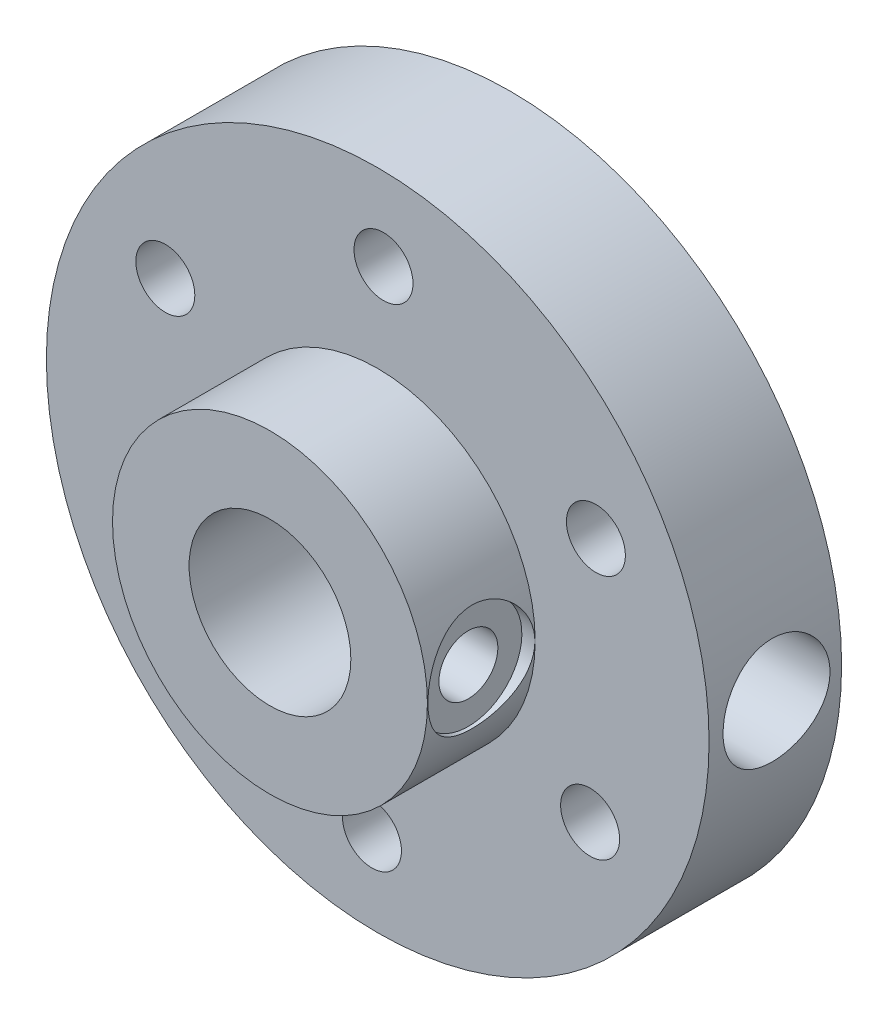
ISO-10303-21;
HEADER;
FILE_DESCRIPTION(('STEP AP214'),'2;1');
FILE_NAME('part.step','',(''),(''),'','','');
FILE_SCHEMA(('AUTOMOTIVE_DESIGN { 1 0 10303 214 1 1 1 1 }'));
ENDSEC;
DATA;
#1=APPLICATION_CONTEXT('core data for automotive mechanical design processes');
#2=APPLICATION_PROTOCOL_DEFINITION('international standard','automotive_design',2000,#1);
#3=PRODUCT_CONTEXT('',#1,'mechanical');
#4=PRODUCT('Part','Part','',(#3));
#5=PRODUCT_RELATED_PRODUCT_CATEGORY('part','',(#4));
#6=PRODUCT_DEFINITION_FORMATION('','',#4);
#7=PRODUCT_DEFINITION_CONTEXT('part definition',#1,'design');
#8=PRODUCT_DEFINITION('design','',#6,#7);
#9=PRODUCT_DEFINITION_SHAPE('','',#8);
#10=(LENGTH_UNIT() NAMED_UNIT(*) SI_UNIT(.MILLI.,.METRE.));
#11=(NAMED_UNIT(*) PLANE_ANGLE_UNIT() SI_UNIT($,.RADIAN.));
#12=(NAMED_UNIT(*) SI_UNIT($,.STERADIAN.) SOLID_ANGLE_UNIT());
#13=UNCERTAINTY_MEASURE_WITH_UNIT(LENGTH_MEASURE(1.E-05),#10,'distance_accuracy_value','');
#14=(GEOMETRIC_REPRESENTATION_CONTEXT(3) GLOBAL_UNCERTAINTY_ASSIGNED_CONTEXT((#13)) GLOBAL_UNIT_ASSIGNED_CONTEXT((#10,
#11,#12)) REPRESENTATION_CONTEXT('',''));
#15=CARTESIAN_POINT('',(0.,0.,0.));
#16=DIRECTION('',(0.,0.,1.));
#17=DIRECTION('',(1.,0.,0.));
#18=AXIS2_PLACEMENT_3D('',#15,#16,#17);
#19=CARTESIAN_POINT('',(0.,0.,5.08));
#20=DIRECTION('',(0.,0.,1.));
#21=DIRECTION('',(1.,0.,0.));
#22=AXIS2_PLACEMENT_3D('',#19,#20,#21);
#23=PLANE('',#22);
#24=CARTESIAN_POINT('',(8.36153460542101,4.57226847881299,5.08));
#25=DIRECTION('',(0.,0.,1.));
#26=DIRECTION('',(1.,0.,0.));
#27=AXIS2_PLACEMENT_3D('',#24,#25,#26);
#28=CIRCLE('',#27,1.13029999999999);
#29=CARTESIAN_POINT('',(9.491834605421,4.57226847881299,5.08));
#30=VERTEX_POINT('',#29);
#31=EDGE_CURVE('E169',#30,#30,#28,.T.);
#32=ORIENTED_EDGE('',*,*,#31,.F.);
#33=EDGE_LOOP('',(#32));
#34=FACE_BOUND('',#33,.T.);
#35=CARTESIAN_POINT('',(8.14046795828538,-4.9551671435108,5.08));
#36=DIRECTION('',(0.,0.,1.));
#37=DIRECTION('',(1.,0.,0.));
#38=AXIS2_PLACEMENT_3D('',#35,#36,#37);
#39=CIRCLE('',#38,1.13029999999999);
#40=CARTESIAN_POINT('',(9.27076795828537,-4.9551671435108,5.08));
#41=VERTEX_POINT('',#40);
#42=EDGE_CURVE('E163',#41,#41,#39,.T.);
#43=ORIENTED_EDGE('',*,*,#42,.F.);
#44=EDGE_LOOP('',(#43));
#45=FACE_BOUND('',#44,.T.);
#46=CARTESIAN_POINT('',(-0.221066647135627,-9.52743562232378,5.08));
#47=DIRECTION('',(0.,0.,1.));
#48=DIRECTION('',(1.,0.,0.));
#49=AXIS2_PLACEMENT_3D('',#46,#47,#48);
#50=CIRCLE('',#49,1.13029999999999);
#51=CARTESIAN_POINT('',(0.909233352864362,-9.52743562232378,5.08));
#52=VERTEX_POINT('',#51);
#53=EDGE_CURVE('E162',#52,#52,#50,.T.);
#54=ORIENTED_EDGE('',*,*,#53,.F.);
#55=EDGE_LOOP('',(#54));
#56=FACE_BOUND('',#55,.T.);
#57=CARTESIAN_POINT('',(-8.36153460542102,-4.57226847881298,5.08));
#58=DIRECTION('',(0.,0.,1.));
#59=DIRECTION('',(1.,0.,0.));
#60=AXIS2_PLACEMENT_3D('',#57,#58,#59);
#61=CIRCLE('',#60,1.13029999999999);
#62=CARTESIAN_POINT('',(-7.23123460542103,-4.57226847881298,5.08));
#63=VERTEX_POINT('',#62);
#64=EDGE_CURVE('E161',#63,#63,#61,.T.);
#65=ORIENTED_EDGE('',*,*,#64,.F.);
#66=EDGE_LOOP('',(#65));
#67=FACE_BOUND('',#66,.T.);
#68=CARTESIAN_POINT('',(-8.14046795828538,4.9551671435108,5.08));
#69=DIRECTION('',(0.,0.,1.));
#70=DIRECTION('',(1.,0.,0.));
#71=AXIS2_PLACEMENT_3D('',#68,#69,#70);
#72=CIRCLE('',#71,1.13029999999999);
#73=CARTESIAN_POINT('',(-7.01016795828539,4.9551671435108,5.08));
#74=VERTEX_POINT('',#73);
#75=EDGE_CURVE('E160',#74,#74,#72,.T.);
#76=ORIENTED_EDGE('',*,*,#75,.F.);
#77=EDGE_LOOP('',(#76));
#78=FACE_BOUND('',#77,.T.);
#79=CARTESIAN_POINT('',(0.221066647135637,9.52743562232378,5.08));
#80=DIRECTION('',(0.,0.,1.));
#81=DIRECTION('',(1.,0.,0.));
#82=AXIS2_PLACEMENT_3D('',#79,#80,#81);
#83=CIRCLE('',#82,1.13029999999999);
#84=CARTESIAN_POINT('',(1.35136664713563,9.52743562232378,5.08));
#85=VERTEX_POINT('',#84);
#86=EDGE_CURVE('E158',#85,#85,#83,.T.);
#87=ORIENTED_EDGE('',*,*,#86,.F.);
#88=EDGE_LOOP('',(#87));
#89=FACE_BOUND('',#88,.T.);
#90=CARTESIAN_POINT('',(0.,0.,5.08));
#91=DIRECTION('',(0.,0.,1.));
#92=DIRECTION('',(1.,0.,0.));
#93=AXIS2_PLACEMENT_3D('',#90,#91,#92);
#94=CIRCLE('',#93,12.7);
#95=CARTESIAN_POINT('',(12.7,0.,5.08));
#96=VERTEX_POINT('',#95);
#97=EDGE_CURVE('E47',#96,#96,#94,.T.);
#98=ORIENTED_EDGE('',*,*,#97,.T.);
#99=EDGE_LOOP('',(#98));
#100=FACE_BOUND('',#99,.T.);
#101=CARTESIAN_POINT('',(0.,0.,5.08));
#102=DIRECTION('',(0.,0.,1.));
#103=DIRECTION('',(1.,0.,0.));
#104=AXIS2_PLACEMENT_3D('',#101,#102,#103);
#105=CIRCLE('',#104,6.035);
#106=CARTESIAN_POINT('',(6.035,0.,5.08));
#107=VERTEX_POINT('',#106);
#108=EDGE_CURVE('E152',#107,#107,#105,.T.);
#109=ORIENTED_EDGE('',*,*,#108,.F.);
#110=EDGE_LOOP('',(#109));
#111=FACE_BOUND('',#110,.T.);
#112=ADVANCED_FACE('F32',(#34,#45,#56,#67,#78,#89,#100,#111),#23,.T.);
#113=CARTESIAN_POINT('',(0.,0.,5.08));
#114=DIRECTION('',(0.,0.,-1.));
#115=DIRECTION('',(-1.,0.,0.));
#116=AXIS2_PLACEMENT_3D('',#113,#114,#115);
#117=CYLINDRICAL_SURFACE('',#116,12.7);
#118=CARTESIAN_POINT('',(12.5334552299037,2.05,2.49468086127914));
#119=CARTESIAN_POINT('',(12.5334572486081,2.04999536101024,2.38033915071411));
#120=CARTESIAN_POINT('',(12.5350368739811,2.04040125716624,2.26593371494406));
#121=CARTESIAN_POINT('',(12.5411794272438,2.00229289242093,2.04032915086702));
#122=CARTESIAN_POINT('',(12.5457451579925,1.97376085536454,1.92913313752065));
#123=CARTESIAN_POINT('',(12.5573296356305,1.89865904966167,1.71324525419515));
#124=CARTESIAN_POINT('',(12.5643463866815,1.85210395366131,1.60854817365192));
#125=CARTESIAN_POINT('',(12.5800399323086,1.74231347431709,1.40846384542003));
#126=CARTESIAN_POINT('',(12.5887165264896,1.67908010421647,1.31307547597461));
#127=CARTESIAN_POINT('',(12.606841849714,1.53710369338824,1.13342119781227));
#128=CARTESIAN_POINT('',(12.6162963769453,1.45823657318114,1.04925391798866));
#129=CARTESIAN_POINT('',(12.6348606942541,1.28749949790615,0.895287049905271));
#130=CARTESIAN_POINT('',(12.6439704643653,1.19562879120595,0.82548829274655));
#131=CARTESIAN_POINT('',(12.6608799861256,1.00085562917657,0.701871612127254));
#132=CARTESIAN_POINT('',(12.6686721324809,0.897894393969266,0.648145174440912));
#133=CARTESIAN_POINT('',(12.682004015988,0.684261988945243,0.55878595651827));
#134=CARTESIAN_POINT('',(12.6875438906108,0.573591290171308,0.523152071940474));
#135=CARTESIAN_POINT('',(12.6957061132466,0.348699499599961,0.471290288547482));
#136=CARTESIAN_POINT('',(12.6983533364051,0.234517502145317,0.45489684092864));
#137=CARTESIAN_POINT('',(12.7005173827566,0.00499490242623773,0.441466737448935));
#138=CARTESIAN_POINT('',(12.700034406106,-0.110345625286645,0.444428843923279));
#139=CARTESIAN_POINT('',(12.6960122223452,-0.337780082331929,0.46949615852993));
#140=CARTESIAN_POINT('',(12.69250145702,-0.449894220981997,0.491423223246062));
#141=CARTESIAN_POINT('',(12.6828498635968,-0.66883065908114,0.553517801313552));
#142=CARTESIAN_POINT('',(12.676708959338,-0.775652805190278,0.59368584287011));
#143=CARTESIAN_POINT('',(12.6624384978364,-0.981505822215447,0.691300924793478));
#144=CARTESIAN_POINT('',(12.6543004612125,-1.08050102773914,0.748821887083634));
#145=CARTESIAN_POINT('',(12.6369408129038,-1.26750127650061,0.879455906203556));
#146=CARTESIAN_POINT('',(12.6277191188619,-1.35550548338196,0.95257014845402));
#147=CARTESIAN_POINT('',(12.6090947578575,-1.51907736232077,1.11330476514415));
#148=CARTESIAN_POINT('',(12.599691225756,-1.59449206830331,1.20108078754988));
#149=CARTESIAN_POINT('',(12.5818648317841,-1.72954681996361,1.38812146753757));
#150=CARTESIAN_POINT('',(12.5734419779078,-1.78918673705754,1.48738621875722));
#151=CARTESIAN_POINT('',(12.5585303809038,-1.89102594503382,1.69475813307762));
#152=CARTESIAN_POINT('',(12.5520435844542,-1.93320769834733,1.80287405768722));
#153=CARTESIAN_POINT('',(12.5417714691285,-1.99876967722349,2.0247846398186));
#154=CARTESIAN_POINT('',(12.5379859280022,-2.02215144960562,2.13857882932733));
#155=CARTESIAN_POINT('',(12.533587671044,-2.04923617993984,2.367249606801));
#156=CARTESIAN_POINT('',(12.5329398640501,-2.05315679603292,2.48209976182659));
#157=CARTESIAN_POINT('',(12.53479705414,-2.04178713932621,2.71081580207145));
#158=CARTESIAN_POINT('',(12.5373019373054,-2.02649756066317,2.82468172270512));
#159=CARTESIAN_POINT('',(12.545149910149,-1.97732679169388,3.04751123451355));
#160=CARTESIAN_POINT('',(12.5504761977329,-1.94355562435339,3.15649974787415));
#161=CARTESIAN_POINT('',(12.5633528217822,-1.85849540026055,3.36727000596034));
#162=CARTESIAN_POINT('',(12.570903283823,-1.80720535437875,3.46905134337138));
#163=CARTESIAN_POINT('',(12.5874594177473,-1.68804659814653,3.66348903726805));
#164=CARTESIAN_POINT('',(12.5964771439035,-1.62003794502003,3.75605858691697));
#165=CARTESIAN_POINT('',(12.6149161412484,-1.4695653671107,3.92854920490543));
#166=CARTESIAN_POINT('',(12.6243374389656,-1.3871004909589,4.00846944013018));
#167=CARTESIAN_POINT('',(12.6426326048491,-1.20909388777417,4.15418331148522));
#168=CARTESIAN_POINT('',(12.6515002619211,-1.11343284537126,4.21983208698007));
#169=CARTESIAN_POINT('',(12.6675903928394,-0.912313540785326,4.3341266084573));
#170=CARTESIAN_POINT('',(12.6748129173081,-0.806855580203656,4.38277287764801));
#171=CARTESIAN_POINT('',(12.6867719343775,-0.589573473926694,4.46145410041529));
#172=CARTESIAN_POINT('',(12.6915186875311,-0.477777766951419,4.49156596280854));
#173=CARTESIAN_POINT('',(12.6980346116816,-0.25063370238323,4.53257168062696));
#174=CARTESIAN_POINT('',(12.6998040118585,-0.135285618928692,4.54346701523732));
#175=CARTESIAN_POINT('',(12.7001629347967,0.0942885201229108,4.54568993714599));
#176=CARTESIAN_POINT('',(12.6987883403433,0.208512442193081,4.5372383324395));
#177=CARTESIAN_POINT('',(12.693086681774,0.433891528590211,4.5014834800992));
#178=CARTESIAN_POINT('',(12.688759631751,0.545046707562534,4.47418032244931));
#179=CARTESIAN_POINT('',(12.6776373278871,0.761056380508561,4.40158008436421));
#180=CARTESIAN_POINT('',(12.6708444951957,0.865916937866126,4.35630065074331));
#181=CARTESIAN_POINT('',(12.6555336403655,1.06658675951149,4.24905740198147));
#182=CARTESIAN_POINT('',(12.6470155447151,1.16239563786151,4.18709287586905));
#183=CARTESIAN_POINT('',(12.6290839047253,1.34335731318889,4.04745045197614));
#184=CARTESIAN_POINT('',(12.6196616993448,1.42838413994096,3.96961040567926));
#185=CARTESIAN_POINT('',(12.6010450682932,1.58424762466422,3.80076729149683));
#186=CARTESIAN_POINT('',(12.5918506965019,1.65508095358988,3.7097611441378));
#187=CARTESIAN_POINT('',(12.5746654639025,1.78097269683277,3.51645907394262));
#188=CARTESIAN_POINT('',(12.5666829324267,1.8359240921702,3.41409271208295));
#189=CARTESIAN_POINT('',(12.5529233379257,1.92776834767308,3.20149754917328));
#190=CARTESIAN_POINT('',(12.5471440449538,1.96467947752625,3.09127683255953));
#191=CARTESIAN_POINT('',(12.5397445223455,2.0112610132162,2.8996174924851));
#192=CARTESIAN_POINT('',(12.5373989510966,2.0257651819024,2.81934726924156));
#193=CARTESIAN_POINT('',(12.5342535981851,2.04513624952944,2.65762242656455));
#194=CARTESIAN_POINT('',(12.5334537912502,2.05000330603064,2.57616782651679));
#195=CARTESIAN_POINT('',(12.5334552299037,2.05,2.49468086127914));
#196=B_SPLINE_CURVE_WITH_KNOTS('',3,(#118,#119,#120,#121,#122,#123,#124,#125,#126,#127,#128,
#129,#130,#131,#132,#133,#134,#135,#136,#137,#138,#139,#140,#141,#142,#143,#144,#145,#146,#147,
#148,#149,#150,#151,#152,#153,#154,#155,#156,#157,#158,#159,#160,#161,#162,#163,#164,#165,#166,
#167,#168,#169,#170,#171,#172,#173,#174,#175,#176,#177,#178,#179,#180,#181,#182,#183,#184,#185,
#186,#187,#188,#189,#190,#191,#192,#193,#194,#195),.UNSPECIFIED.,.T.,.F.,(4,2,2,2,2,2,2,2,2,2,2,
2,2,2,2,2,2,2,2,2,2,2,2,2,2,2,2,2,2,2,2,2,2,2,2,2,2,2,4),(0.,0.342727194840897,
0.685776547529513,1.02854720764477,1.37127651065459,1.71684348397928,2.06243043990304,
2.40994864619874,2.75744563796913,3.10193024758134,3.44639282980552,3.78765448694477,
4.12892602665112,4.47167238910797,4.81444481686668,5.16111897705515,5.50779596297476,
5.85482036232487,6.20181620637773,6.54492228352797,6.88801596331869,7.22908904165562,
7.57018138042652,7.9142323196865,8.25830590956205,8.60572388060592,8.95313115981523,
9.29908697343599,9.64501615607223,9.98701693637679,10.3290160842241,10.6706803278219,
11.0123591324407,11.35772026422,11.7031623049214,12.0508805220294,12.3982458654641,
12.6424984263722,12.8867469938809),.UNSPECIFIED.);
#197=CARTESIAN_POINT('',(12.5334552299037,2.05,2.49468086127914));
#198=VERTEX_POINT('',#197);
#199=EDGE_CURVE('E10',#198,#198,#196,.T.);
#200=ORIENTED_EDGE('',*,*,#199,.T.);
#201=EDGE_LOOP('',(#200));
#202=FACE_BOUND('',#201,.T.);
#203=ORIENTED_EDGE('',*,*,#97,.F.);
#204=EDGE_LOOP('',(#203));
#205=FACE_BOUND('',#204,.T.);
#206=CARTESIAN_POINT('',(0.,0.,0.));
#207=DIRECTION('',(0.,0.,1.));
#208=DIRECTION('',(1.,0.,0.));
#209=AXIS2_PLACEMENT_3D('',#206,#207,#208);
#210=CIRCLE('',#209,12.7);
#211=CARTESIAN_POINT('',(12.7,0.,0.));
#212=VERTEX_POINT('',#211);
#213=EDGE_CURVE('E51',#212,#212,#210,.T.);
#214=ORIENTED_EDGE('',*,*,#213,.T.);
#215=EDGE_LOOP('',(#214));
#216=FACE_BOUND('',#215,.T.);
#217=ADVANCED_FACE('F34',(#202,#205,#216),#117,.T.);
#218=CARTESIAN_POINT('',(0.,0.,0.));
#219=DIRECTION('',(0.,0.,1.));
#220=DIRECTION('',(1.,0.,0.));
#221=AXIS2_PLACEMENT_3D('',#218,#219,#220);
#222=PLANE('',#221);
#223=CARTESIAN_POINT('',(8.36153460542101,4.57226847881299,0.));
#224=DIRECTION('',(0.,0.,1.));
#225=DIRECTION('',(1.,0.,0.));
#226=AXIS2_PLACEMENT_3D('',#223,#224,#225);
#227=CIRCLE('',#226,1.13029999999999);
#228=CARTESIAN_POINT('',(9.491834605421,4.57226847881299,0.));
#229=VERTEX_POINT('',#228);
#230=EDGE_CURVE('E58',#229,#229,#227,.T.);
#231=ORIENTED_EDGE('',*,*,#230,.T.);
#232=EDGE_LOOP('',(#231));
#233=FACE_BOUND('',#232,.T.);
#234=CARTESIAN_POINT('',(8.14046795828538,-4.9551671435108,0.));
#235=DIRECTION('',(0.,0.,1.));
#236=DIRECTION('',(1.,0.,0.));
#237=AXIS2_PLACEMENT_3D('',#234,#235,#236);
#238=CIRCLE('',#237,1.13029999999999);
#239=CARTESIAN_POINT('',(9.27076795828537,-4.9551671435108,0.));
#240=VERTEX_POINT('',#239);
#241=EDGE_CURVE('E125',#240,#240,#238,.T.);
#242=ORIENTED_EDGE('',*,*,#241,.T.);
#243=EDGE_LOOP('',(#242));
#244=FACE_BOUND('',#243,.T.);
#245=CARTESIAN_POINT('',(-0.221066647135627,-9.52743562232378,0.));
#246=DIRECTION('',(0.,0.,1.));
#247=DIRECTION('',(1.,0.,0.));
#248=AXIS2_PLACEMENT_3D('',#245,#246,#247);
#249=CIRCLE('',#248,1.13029999999999);
#250=CARTESIAN_POINT('',(0.909233352864361,-9.52743562232378,0.));
#251=VERTEX_POINT('',#250);
#252=EDGE_CURVE('E129',#251,#251,#249,.T.);
#253=ORIENTED_EDGE('',*,*,#252,.T.);
#254=EDGE_LOOP('',(#253));
#255=FACE_BOUND('',#254,.T.);
#256=CARTESIAN_POINT('',(-8.36153460542102,-4.57226847881298,0.));
#257=DIRECTION('',(0.,0.,1.));
#258=DIRECTION('',(1.,0.,0.));
#259=AXIS2_PLACEMENT_3D('',#256,#257,#258);
#260=CIRCLE('',#259,1.13029999999999);
#261=CARTESIAN_POINT('',(-7.23123460542103,-4.57226847881298,0.));
#262=VERTEX_POINT('',#261);
#263=EDGE_CURVE('E133',#262,#262,#260,.T.);
#264=ORIENTED_EDGE('',*,*,#263,.T.);
#265=EDGE_LOOP('',(#264));
#266=FACE_BOUND('',#265,.T.);
#267=CARTESIAN_POINT('',(-8.14046795828538,4.9551671435108,0.));
#268=DIRECTION('',(0.,0.,1.));
#269=DIRECTION('',(1.,0.,0.));
#270=AXIS2_PLACEMENT_3D('',#267,#268,#269);
#271=CIRCLE('',#270,1.13029999999999);
#272=CARTESIAN_POINT('',(-7.01016795828539,4.9551671435108,0.));
#273=VERTEX_POINT('',#272);
#274=EDGE_CURVE('E137',#273,#273,#271,.T.);
#275=ORIENTED_EDGE('',*,*,#274,.T.);
#276=EDGE_LOOP('',(#275));
#277=FACE_BOUND('',#276,.T.);
#278=CARTESIAN_POINT('',(0.221066647135637,9.52743562232378,0.));
#279=DIRECTION('',(0.,0.,1.));
#280=DIRECTION('',(1.,0.,0.));
#281=AXIS2_PLACEMENT_3D('',#278,#279,#280);
#282=CIRCLE('',#281,1.13029999999999);
#283=CARTESIAN_POINT('',(1.35136664713562,9.52743562232378,0.));
#284=VERTEX_POINT('',#283);
#285=EDGE_CURVE('E141',#284,#284,#282,.T.);
#286=ORIENTED_EDGE('',*,*,#285,.T.);
#287=EDGE_LOOP('',(#286));
#288=FACE_BOUND('',#287,.T.);
#289=CARTESIAN_POINT('',(0.,0.,0.));
#290=DIRECTION('',(0.,0.,1.));
#291=DIRECTION('',(1.,0.,0.));
#292=AXIS2_PLACEMENT_3D('',#289,#290,#291);
#293=CIRCLE('',#292,3.1);
#294=CARTESIAN_POINT('',(3.1,0.,0.));
#295=VERTEX_POINT('',#294);
#296=EDGE_CURVE('E145',#295,#295,#293,.F.);
#297=ORIENTED_EDGE('',*,*,#296,.F.);
#298=EDGE_LOOP('',(#297));
#299=FACE_BOUND('',#298,.T.);
#300=ORIENTED_EDGE('',*,*,#213,.F.);
#301=EDGE_LOOP('',(#300));
#302=FACE_BOUND('',#301,.T.);
#303=ADVANCED_FACE('F105',(#233,#244,#255,#266,#277,#288,#299,#302),#222,.F.);
#304=CARTESIAN_POINT('',(0.,0.,9.21));
#305=DIRECTION('',(0.,0.,-1.));
#306=DIRECTION('',(-1.,0.,0.));
#307=AXIS2_PLACEMENT_3D('',#304,#305,#306);
#308=CYLINDRICAL_SURFACE('',#307,6.035);
#309=CARTESIAN_POINT('',(5.67615406767646,2.05,7.14097271657416));
#310=CARTESIAN_POINT('',(5.67615329732965,2.05000098302527,7.02944982676044));
#311=CARTESIAN_POINT('',(5.6794767026821,2.04086878834927,6.91793359372519));
#312=CARTESIAN_POINT('',(5.69233877855883,2.00471060878538,6.69821356488151));
#313=CARTESIAN_POINT('',(5.70187827696146,1.97768224042246,6.59001021230266));
#314=CARTESIAN_POINT('',(5.72597001601498,1.90679757728606,6.38013623788336));
#315=CARTESIAN_POINT('',(5.74051211830512,1.86297529701358,6.27845289318462));
#316=CARTESIAN_POINT('',(5.77295556391696,1.75986363514059,6.08384724069902));
#317=CARTESIAN_POINT('',(5.7908576918675,1.70057063957426,5.99092698688809));
#318=CARTESIAN_POINT('',(5.82882009867105,1.56561882985739,5.81270799441414));
#319=CARTESIAN_POINT('',(5.84893564847816,1.48943669472425,5.72781719947592));
#320=CARTESIAN_POINT('',(5.88859212235395,1.32398503441914,5.57173688194607));
#321=CARTESIAN_POINT('',(5.90813294962692,1.23471331966166,5.50054965626312));
#322=CARTESIAN_POINT('',(5.94508065640441,1.0426169728112,5.37202985055787));
#323=CARTESIAN_POINT('',(5.962414991596,0.939489628901688,5.31512702718522));
#324=CARTESIAN_POINT('',(5.99234348155934,0.724436410317064,5.21963944815242));
#325=CARTESIAN_POINT('',(6.00493896603385,0.612513014451183,5.18104955316164));
#326=CARTESIAN_POINT('',(6.02357897393679,0.387323724661142,5.12467347240352));
#327=CARTESIAN_POINT('',(6.02984314025605,0.274251433392958,5.10618794391421));
#328=CARTESIAN_POINT('',(6.03589562251155,0.0464479832614385,5.08831918531564));
#329=CARTESIAN_POINT('',(6.03568567037669,-0.0682827237406328,5.08893084640719));
#330=CARTESIAN_POINT('',(6.02896109552273,-0.291187151007666,5.10880078122801));
#331=CARTESIAN_POINT('',(6.02270348320838,-0.399437662835165,5.12729893968682));
#332=CARTESIAN_POINT('',(6.00491147565195,-0.611195012056191,5.18115664234734));
#333=CARTESIAN_POINT('',(5.99337671943068,-0.714701524406918,5.2165173400258));
#334=CARTESIAN_POINT('',(5.96600469165288,-0.915666025728827,5.30352646366927));
#335=CARTESIAN_POINT('',(5.95011185331009,-1.01302441362591,5.35538673536954));
#336=CARTESIAN_POINT('',(5.91567136087184,-1.19787782811748,5.47374661459075));
#337=CARTESIAN_POINT('',(5.89712294950857,-1.28537002848719,5.54025040080176));
#338=CARTESIAN_POINT('',(5.85825257802921,-1.45252396285309,5.68981613689392));
#339=CARTESIAN_POINT('',(5.83788823975745,-1.53159562069781,5.77352749936972));
#340=CARTESIAN_POINT('',(5.798438252496,-1.67477394166908,5.9531891318542));
#341=CARTESIAN_POINT('',(5.77935281705163,-1.73887811001055,6.04914143807084));
#342=CARTESIAN_POINT('',(5.74438423733127,-1.85116165777935,6.25249660014436));
#343=CARTESIAN_POINT('',(5.7285545801581,-1.89908226681902,6.36005224266023));
#344=CARTESIAN_POINT('',(5.70250811439952,-1.97592814030375,6.58238045950079));
#345=CARTESIAN_POINT('',(5.6922888447821,-2.00486173461262,6.69714984480909));
#346=CARTESIAN_POINT('',(5.6791804908733,-2.04169059705267,6.92491348231771));
#347=CARTESIAN_POINT('',(5.67597173912172,-2.05050420406226,7.03774084558463));
#348=CARTESIAN_POINT('',(5.67635242942246,-2.04945140195118,7.26328417791204));
#349=CARTESIAN_POINT('',(5.6799405749866,-2.03958855530927,7.37600016411416));
#350=CARTESIAN_POINT('',(5.69319116526613,-2.00228923171862,7.59386957979904));
#351=CARTESIAN_POINT('',(5.7026293376868,-1.97550092273185,7.69914909616943));
#352=CARTESIAN_POINT('',(5.72626698620871,-1.90589429405493,7.90369420323873));
#353=CARTESIAN_POINT('',(5.74046732658698,-1.86307306441535,8.00295869841879));
#354=CARTESIAN_POINT('',(5.77260256261031,-1.76103012793416,8.19624740673119));
#355=CARTESIAN_POINT('',(5.79064420016713,-1.70131885284839,8.28999492954049));
#356=CARTESIAN_POINT('',(5.82822626639219,-1.56774050372242,8.46647084652021));
#357=CARTESIAN_POINT('',(5.84776715203128,-1.49386910331319,8.54919585983503));
#358=CARTESIAN_POINT('',(5.88733407420208,-1.32965971841098,8.70557910363005));
#359=CARTESIAN_POINT('',(5.90733511693807,-1.23868063049925,8.77857248200737));
#360=CARTESIAN_POINT('',(5.94460395423278,-1.04527213934157,8.90830463113573));
#361=CARTESIAN_POINT('',(5.96187183432466,-0.942843094588418,8.96504391059696));
#362=CARTESIAN_POINT('',(5.99165583706325,-0.729902204282967,9.06015195185921));
#363=CARTESIAN_POINT('',(6.00420126531374,-0.619445459285833,9.09863440969226));
#364=CARTESIAN_POINT('',(6.02325149476547,-0.393115711002001,9.15630987638758));
#365=CARTESIAN_POINT('',(6.0297585699389,-0.277244763920239,9.17551014691711));
#366=CARTESIAN_POINT('',(6.03582076615483,-0.0494456473287122,9.19340303149523));
#367=CARTESIAN_POINT('',(6.0356988830418,0.0623998783255783,9.19304844325447));
#368=CARTESIAN_POINT('',(6.02931894082078,0.284363600959493,9.17420665867746));
#369=CARTESIAN_POINT('',(6.02306141217707,0.394481946428275,9.15572102988109));
#370=CARTESIAN_POINT('',(6.00523638255454,0.607992521984599,9.1017807539556));
#371=CARTESIAN_POINT('',(5.99376110128781,0.711467348300914,9.06662037417479));
#372=CARTESIAN_POINT('',(5.96668301296469,0.911085145583175,8.9806037215459));
#373=CARTESIAN_POINT('',(5.95107945036118,1.00722677029227,8.9297445752668));
#374=CARTESIAN_POINT('',(5.91661134944207,1.1934158468392,8.81156335300297));
#375=CARTESIAN_POINT('',(5.89764580101165,1.2830953096062,8.74369140396709));
#376=CARTESIAN_POINT('',(5.85882210646529,1.45010105170177,8.59433610513015));
#377=CARTESIAN_POINT('',(5.838963671604,1.5274232975469,8.51284832870727));
#378=CARTESIAN_POINT('',(5.79961700252869,1.67075581044161,8.33457390760033));
#379=CARTESIAN_POINT('',(5.78017751154664,1.73617069236164,8.23729620277053));
#380=CARTESIAN_POINT('',(5.74486160414566,1.84968671984251,8.03251910101977));
#381=CARTESIAN_POINT('',(5.72898442901132,1.89779155348282,7.92502188764529));
#382=CARTESIAN_POINT('',(5.70324430216268,1.97377753337524,7.70635586569714));
#383=CARTESIAN_POINT('',(5.69320302905525,2.00226386702023,7.59541913581745));
#384=CARTESIAN_POINT('',(5.67965955542806,2.04037099465054,7.36997591740819));
#385=CARTESIAN_POINT('',(5.67615485857454,2.04999899074963,7.25547080864386));
#386=CARTESIAN_POINT('',(5.67615406767646,2.05,7.14097271657416));
#387=B_SPLINE_CURVE_WITH_KNOTS('',3,(#309,#310,#311,#312,#313,#314,#315,#316,#317,#318,#319,
#320,#321,#322,#323,#324,#325,#326,#327,#328,#329,#330,#331,#332,#333,#334,#335,#336,#337,#338,
#339,#340,#341,#342,#343,#344,#345,#346,#347,#348,#349,#350,#351,#352,#353,#354,#355,#356,#357,
#358,#359,#360,#361,#362,#363,#364,#365,#366,#367,#368,#369,#370,#371,#372,#373,#374,#375,#376,
#377,#378,#379,#380,#381,#382,#383,#384,#385,#386),.UNSPECIFIED.,.T.,.F.,(4,2,2,2,2,2,2,2,2,2,2,
2,2,2,2,2,2,2,2,2,2,2,2,2,2,2,2,2,2,2,2,2,2,2,2,2,2,2,4),(0.,0.334144317512374,
0.668333146488088,1.00184865426973,1.33544214127953,1.68134957448726,2.02731493620157,
2.38269530044044,2.73797587185311,3.08045803061925,3.42284857079571,3.75130042941245,
4.0797747588998,4.41264934985952,4.74561905368225,5.09482937830342,5.44409786790703,
5.7987124104254,6.1531712744868,6.4910972050888,6.82895868380357,7.15460661350002,
7.48031367644777,7.81664887588975,8.15308700070757,8.5064381175983,8.85977817432776,
9.21088791071762,9.56186536962125,9.89575753415898,10.2296208342114,10.5577998888567,
10.8860390475628,11.2266919914438,11.5674559007642,11.9222222998763,12.2769130676303,
12.6201027628762,12.9631613663163),.UNSPECIFIED.);
#388=CARTESIAN_POINT('',(5.67615406767646,2.05,7.14097271657416));
#389=VERTEX_POINT('',#388);
#390=EDGE_CURVE('E43',#389,#389,#387,.T.);
#391=ORIENTED_EDGE('',*,*,#390,.T.);
#392=EDGE_LOOP('',(#391));
#393=FACE_BOUND('',#392,.T.);
#394=CARTESIAN_POINT('',(0.,0.,9.21));
#395=DIRECTION('',(0.,0.,1.));
#396=DIRECTION('',(1.,0.,0.));
#397=AXIS2_PLACEMENT_3D('',#394,#395,#396);
#398=CIRCLE('',#397,6.035);
#399=CARTESIAN_POINT('',(6.035,0.,9.21));
#400=VERTEX_POINT('',#399);
#401=EDGE_CURVE('E149',#400,#400,#398,.T.);
#402=ORIENTED_EDGE('',*,*,#401,.F.);
#403=EDGE_LOOP('',(#402));
#404=FACE_BOUND('',#403,.T.);
#405=ORIENTED_EDGE('',*,*,#108,.T.);
#406=EDGE_LOOP('',(#405));
#407=FACE_BOUND('',#406,.T.);
#408=ADVANCED_FACE('F60',(#393,#404,#407),#308,.T.);
#409=CARTESIAN_POINT('',(0.,0.,9.21));
#410=DIRECTION('',(0.,0.,1.));
#411=DIRECTION('',(1.,0.,0.));
#412=AXIS2_PLACEMENT_3D('',#409,#410,#411);
#413=PLANE('',#412);
#414=CARTESIAN_POINT('',(0.,0.,9.21));
#415=DIRECTION('',(0.,0.,1.));
#416=DIRECTION('',(1.,0.,0.));
#417=AXIS2_PLACEMENT_3D('',#414,#415,#416);
#418=CIRCLE('',#417,3.1);
#419=CARTESIAN_POINT('',(3.1,0.,9.21));
#420=VERTEX_POINT('',#419);
#421=EDGE_CURVE('E157',#420,#420,#418,.T.);
#422=ORIENTED_EDGE('',*,*,#421,.F.);
#423=EDGE_LOOP('',(#422));
#424=FACE_BOUND('',#423,.T.);
#425=ORIENTED_EDGE('',*,*,#401,.T.);
#426=EDGE_LOOP('',(#425));
#427=FACE_BOUND('',#426,.T.);
#428=ADVANCED_FACE('F98',(#424,#427),#413,.T.);
#429=CARTESIAN_POINT('',(0.,0.,-0.000999999999999265));
#430=DIRECTION('',(0.,0.,1.));
#431=DIRECTION('',(1.,0.,0.));
#432=AXIS2_PLACEMENT_3D('',#429,#430,#431);
#433=CYLINDRICAL_SURFACE('',#432,3.1);
#434=CARTESIAN_POINT('',(3.1,0.,1.36438086127915));
#435=CARTESIAN_POINT('',(3.10000120074954,0.0613321430336925,1.36437922276112));
#436=CARTESIAN_POINT('',(3.09816376339156,0.122652776637039,1.36938864330652));
#437=CARTESIAN_POINT('',(3.09101675890993,0.243468054019813,1.38921807309489));
#438=CARTESIAN_POINT('',(3.0857074787233,0.302962848273808,1.40403727159146));
#439=CARTESIAN_POINT('',(3.07218852745522,0.418367015607754,1.44289695103708));
#440=CARTESIAN_POINT('',(3.06398426390645,0.474282845334627,1.46692024680225));
#441=CARTESIAN_POINT('',(3.04549765773156,0.581288398877817,1.52342128838093));
#442=CARTESIAN_POINT('',(3.03521479171023,0.632376902402152,1.5559011641684));
#443=CARTESIAN_POINT('',(3.0131726286101,0.730345739651794,1.62976873211688));
#444=CARTESIAN_POINT('',(3.00137314593432,0.777004464882072,1.67143824513714));
#445=CARTESIAN_POINT('',(2.97783120935817,0.862847747965236,1.76190385001697));
#446=CARTESIAN_POINT('',(2.96608877246512,0.902030195940648,1.81070194679185));
#447=CARTESIAN_POINT('',(2.94352962789113,0.973179741588535,1.91616032399437));
#448=CARTESIAN_POINT('',(2.93276075664556,1.00484032258375,1.97303864986903));
#449=CARTESIAN_POINT('',(2.91398963087958,1.05804840602176,2.09176779778421));
#450=CARTESIAN_POINT('',(2.90598634020346,1.07959969710734,2.15361674679689));
#451=CARTESIAN_POINT('',(2.8940804708056,1.11111370297965,2.27798715138402));
#452=CARTESIAN_POINT('',(2.890029456036,1.12149753438077,2.34038722688494));
#453=CARTESIAN_POINT('',(2.88605111525467,1.1316986913503,2.46616549449033));
#454=CARTESIAN_POINT('',(2.88612220348591,1.13152008024882,2.52954330108511));
#455=CARTESIAN_POINT('',(2.89025150299892,1.12092469245633,2.65169608765739));
#456=CARTESIAN_POINT('',(2.89408588250864,1.11108266037078,2.71052986659312));
#457=CARTESIAN_POINT('',(2.90493922315069,1.08238669946617,2.82564492075857));
#458=CARTESIAN_POINT('',(2.91195863744315,1.06353148825029,2.88192583151772));
#459=CARTESIAN_POINT('',(2.92853213487955,1.01701353752791,2.99154333054644));
#460=CARTESIAN_POINT('',(2.93813013618724,0.989196346434862,3.04480744346564));
#461=CARTESIAN_POINT('',(2.95876375142142,0.925651552714977,3.14608242473241));
#462=CARTESIAN_POINT('',(2.96979984155684,0.889921327010779,3.19409154320761));
#463=CARTESIAN_POINT('',(2.99291829094849,0.808901411311478,3.28668821432142));
#464=CARTESIAN_POINT('',(3.00502267301574,0.763149980941691,3.33086720416274));
#465=CARTESIAN_POINT('',(3.02831098274679,0.664745322451757,3.41104333729502));
#466=CARTESIAN_POINT('',(3.03949478385098,0.61209114792744,3.44703935680213));
#467=CARTESIAN_POINT('',(3.05988302724086,0.500379436903604,3.51024570809041));
#468=CARTESIAN_POINT('',(3.06905778509989,0.441243044304873,3.53732691908267));
#469=CARTESIAN_POINT('',(3.08417541156957,0.318836711408973,3.58102309102623));
#470=CARTESIAN_POINT('',(3.09011963382643,0.255568514871459,3.59764243612988));
#471=CARTESIAN_POINT('',(3.09787202104598,0.13013836430585,3.61917375621225));
#472=CARTESIAN_POINT('',(3.09987453241213,0.0680828456854345,3.62463637037956));
#473=CARTESIAN_POINT('',(3.10011385482826,-0.0560828788841574,3.62529350234877));
#474=CARTESIAN_POINT('',(3.09835144719382,-0.118193070813429,3.62049015059726));
#475=CARTESIAN_POINT('',(3.09138734335181,-0.238371332868485,3.60117508025267));
#476=CARTESIAN_POINT('',(3.08631141434872,-0.296504463961768,3.58701815406786));
#477=CARTESIAN_POINT('',(3.07335654014166,-0.409534268341914,3.54985879984108));
#478=CARTESIAN_POINT('',(3.06547723032293,-0.464430519548856,3.52685522114975));
#479=CARTESIAN_POINT('',(3.0474178519217,-0.571193059468396,3.47193405617355));
#480=CARTESIAN_POINT('',(3.03717818837062,-0.622926992468526,3.43977936672063));
#481=CARTESIAN_POINT('',(3.01553872289802,-0.72043371674487,3.3677392156204));
#482=CARTESIAN_POINT('',(3.0041385106467,-0.766204386486752,3.32785101513151));
#483=CARTESIAN_POINT('',(2.98066258746683,-0.853104654153345,3.23890142250109));
#484=CARTESIAN_POINT('',(2.96858408250104,-0.893842672218977,3.18945722578869));
#485=CARTESIAN_POINT('',(2.94572704776196,-0.966513168766981,3.08418970841957));
#486=CARTESIAN_POINT('',(2.93494860221976,-0.998445076872015,3.02836597488724));
#487=CARTESIAN_POINT('',(2.91597640256911,-1.0525733564952,2.91159332662789));
#488=CARTESIAN_POINT('',(2.90778857547031,-1.07474744797188,2.85063305758787));
#489=CARTESIAN_POINT('',(2.89513718999684,-1.10838162587641,2.72546524374459));
#490=CARTESIAN_POINT('',(2.89067149744614,-1.11984785237288,2.6612595821977));
#491=CARTESIAN_POINT('',(2.88624329087325,-1.13120875356745,2.53564015625745));
#492=CARTESIAN_POINT('',(2.8860227683771,-1.13176645086613,2.47429490809219));
#493=CARTESIAN_POINT('',(2.8894544318839,-1.12297590899282,2.35243455813735));
#494=CARTESIAN_POINT('',(2.89310629055259,-1.11362850710378,2.29191938661895));
#495=CARTESIAN_POINT('',(2.90366201418016,-1.08579815741329,2.17510402938316));
#496=CARTESIAN_POINT('',(2.91047451790768,-1.06757118461488,2.11873391301623));
#497=CARTESIAN_POINT('',(2.92653544953912,-1.02271937897829,2.00981556474861));
#498=CARTESIAN_POINT('',(2.93578447635993,-0.99609248105291,1.95726827658812));
#499=CARTESIAN_POINT('',(2.95625536884101,-0.933640334129915,1.85461634707987));
#500=CARTESIAN_POINT('',(2.96755305903415,-0.897419828998403,1.8047674580307));
#501=CARTESIAN_POINT('',(2.99057364903489,-0.817434721524966,1.71164272701633));
#502=CARTESIAN_POINT('',(3.00229667927227,-0.773667789380301,1.66836892275685));
#503=CARTESIAN_POINT('',(3.02555134788035,-0.677212477567054,1.5874219111637));
#504=CARTESIAN_POINT('',(3.03704408758119,-0.624187371217567,1.55013707470768));
#505=CARTESIAN_POINT('',(3.05791842004701,-0.512224539475453,1.48502907695746));
#506=CARTESIAN_POINT('',(3.06730004134205,-0.453286894001586,1.45720578779549));
#507=CARTESIAN_POINT('',(3.08303872680783,-0.329869765915184,1.4115476171113));
#508=CARTESIAN_POINT('',(3.08933053682645,-0.265302081267983,1.39392693191236));
#509=CARTESIAN_POINT('',(3.09780962849293,-0.133817678431578,1.37034697635863));
#510=CARTESIAN_POINT('',(3.09999869020498,-0.0669019918165643,1.3643826485984));
#511=CARTESIAN_POINT('',(3.1,0.,1.36438086127915));
#512=B_SPLINE_CURVE_WITH_KNOTS('',3,(#434,#435,#436,#437,#438,#439,#440,#441,#442,#443,#444,
#445,#446,#447,#448,#449,#450,#451,#452,#453,#454,#455,#456,#457,#458,#459,#460,#461,#462,#463,
#464,#465,#466,#467,#468,#469,#470,#471,#472,#473,#474,#475,#476,#477,#478,#479,#480,#481,#482,
#483,#484,#485,#486,#487,#488,#489,#490,#491,#492,#493,#494,#495,#496,#497,#498,#499,#500,#501,
#502,#503,#504,#505,#506,#507,#508,#509,#510,#511),.UNSPECIFIED.,.T.,.F.,(4,2,2,2,2,2,2,2,2,2,2,
2,2,2,2,2,2,2,2,2,2,2,2,2,2,2,2,2,2,2,2,2,2,2,2,2,2,2,4),(0.,0.183749801446956,
0.367484418463102,0.550877639075801,0.734317096027845,0.924450883028623,1.11463824851076,
1.31159613097639,1.5084801407548,1.69764707304057,1.88674123402476,2.06523050499193,
2.24374517900849,2.42551761740391,2.60735040164279,2.80068574258528,2.9940476186426,
3.19009811267114,3.38606639493882,3.57210308612207,3.75810117375331,3.93742060847946,
4.11676337447285,4.30125844980018,4.48581898425165,4.68048957473779,4.87517277120198,
5.07029821046058,5.26531169270713,5.44843273086426,5.63153829094401,5.80965250933419,
5.9878105505453,6.17492850728451,6.36210433658671,6.55864190809432,6.7551768233957,
6.9557007955486,7.15613774597354),.UNSPECIFIED.);
#513=CARTESIAN_POINT('',(3.1,0.,1.36438086127915));
#514=VERTEX_POINT('',#513);
#515=EDGE_CURVE('E231',#514,#514,#512,.T.);
#516=ORIENTED_EDGE('',*,*,#515,.T.);
#517=EDGE_LOOP('',(#516));
#518=FACE_BOUND('',#517,.T.);
#519=CARTESIAN_POINT('',(3.1,0.,6.01067271657417));
#520=CARTESIAN_POINT('',(3.10000120074954,0.0613321430336925,6.01067107805614));
#521=CARTESIAN_POINT('',(3.09816376339156,0.122652776637039,6.01568049860154));
#522=CARTESIAN_POINT('',(3.09101675890993,0.243468054019813,6.03550992838991));
#523=CARTESIAN_POINT('',(3.0857074787233,0.302962848273807,6.05032912688648));
#524=CARTESIAN_POINT('',(3.07218852745522,0.418367015607754,6.0891888063321));
#525=CARTESIAN_POINT('',(3.06398426390645,0.474282845334627,6.11321210209727));
#526=CARTESIAN_POINT('',(3.04549765773156,0.581288398877817,6.16971314367595));
#527=CARTESIAN_POINT('',(3.03521479171023,0.632376902402152,6.20219301946342));
#528=CARTESIAN_POINT('',(3.0131726286101,0.730345739651794,6.2760605874119));
#529=CARTESIAN_POINT('',(3.00137314593432,0.777004464882072,6.31773010043216));
#530=CARTESIAN_POINT('',(2.97783120935817,0.862847747965236,6.40819570531198));
#531=CARTESIAN_POINT('',(2.96608877246512,0.902030195940648,6.45699380208686));
#532=CARTESIAN_POINT('',(2.94352962789113,0.973179741588535,6.56245217928939));
#533=CARTESIAN_POINT('',(2.93276075664556,1.00484032258375,6.61933050516405));
#534=CARTESIAN_POINT('',(2.91398963087958,1.05804840602176,6.73805965307923));
#535=CARTESIAN_POINT('',(2.90598634020347,1.07959969710734,6.79990860209191));
#536=CARTESIAN_POINT('',(2.8940804708056,1.11111370297965,6.92427900667904));
#537=CARTESIAN_POINT('',(2.890029456036,1.12149753438076,6.98667908217996));
#538=CARTESIAN_POINT('',(2.88605111525467,1.13169869135029,7.11245734978535));
#539=CARTESIAN_POINT('',(2.88612220348591,1.13152008024882,7.17583515638013));
#540=CARTESIAN_POINT('',(2.89025150299892,1.12092469245633,7.29798794295241));
#541=CARTESIAN_POINT('',(2.89408588250864,1.11108266037078,7.35682172188814));
#542=CARTESIAN_POINT('',(2.90493922315069,1.08238669946617,7.47193677605359));
#543=CARTESIAN_POINT('',(2.91195863744315,1.06353148825029,7.52821768681274));
#544=CARTESIAN_POINT('',(2.92853213487955,1.01701353752791,7.63783518584146));
#545=CARTESIAN_POINT('',(2.93813013618724,0.989196346434861,7.69109929876067));
#546=CARTESIAN_POINT('',(2.95876375142142,0.925651552714976,7.79237428002743));
#547=CARTESIAN_POINT('',(2.96979984155685,0.889921327010778,7.84038339850263));
#548=CARTESIAN_POINT('',(2.99291829094849,0.808901411311478,7.93298006961643));
#549=CARTESIAN_POINT('',(3.00502267301574,0.763149980941691,7.97715905945776));
#550=CARTESIAN_POINT('',(3.02831098274679,0.664745322451757,8.05733519259004));
#551=CARTESIAN_POINT('',(3.03949478385098,0.612091147927439,8.09333121209715));
#552=CARTESIAN_POINT('',(3.05988302724086,0.500379436903602,8.15653756338543));
#553=CARTESIAN_POINT('',(3.06905778509989,0.441243044304871,8.18361877437769));
#554=CARTESIAN_POINT('',(3.08417541156957,0.318836711408971,8.22731494632126));
#555=CARTESIAN_POINT('',(3.09011963382643,0.255568514871457,8.2439342914249));
#556=CARTESIAN_POINT('',(3.09787202104598,0.130138364305849,8.26546561150727));
#557=CARTESIAN_POINT('',(3.09987453241213,0.0680828456854328,8.27092822567458));
#558=CARTESIAN_POINT('',(3.10011385482826,-0.0560828788841588,8.27158535764378));
#559=CARTESIAN_POINT('',(3.09835144719382,-0.11819307081343,8.26678200589227));
#560=CARTESIAN_POINT('',(3.09138734335181,-0.238371332868486,8.24746693554769));
#561=CARTESIAN_POINT('',(3.08631141434872,-0.296504463961768,8.23331000936288));
#562=CARTESIAN_POINT('',(3.07335654014166,-0.409534268341914,8.1961506551361));
#563=CARTESIAN_POINT('',(3.06547723032293,-0.464430519548857,8.17314707644477));
#564=CARTESIAN_POINT('',(3.0474178519217,-0.571193059468397,8.11822591146857));
#565=CARTESIAN_POINT('',(3.03717818837062,-0.622926992468527,8.08607122201564));
#566=CARTESIAN_POINT('',(3.01553872289802,-0.720433716744871,8.01403107091542));
#567=CARTESIAN_POINT('',(3.0041385106467,-0.766204386486753,7.97414287042653));
#568=CARTESIAN_POINT('',(2.98066258746683,-0.853104654153345,7.88519327779611));
#569=CARTESIAN_POINT('',(2.96858408250104,-0.893842672218977,7.83574908108371));
#570=CARTESIAN_POINT('',(2.94572704776196,-0.966513168766982,7.73048156371458));
#571=CARTESIAN_POINT('',(2.93494860221976,-0.998445076872015,7.67465783018226));
#572=CARTESIAN_POINT('',(2.91597640256911,-1.0525733564952,7.55788518192291));
#573=CARTESIAN_POINT('',(2.90778857547031,-1.07474744797188,7.49692491288289));
#574=CARTESIAN_POINT('',(2.89513718999684,-1.10838162587641,7.37175709903961));
#575=CARTESIAN_POINT('',(2.89067149744614,-1.11984785237288,7.30755143749272));
#576=CARTESIAN_POINT('',(2.88624329087325,-1.13120875356745,7.18193201155247));
#577=CARTESIAN_POINT('',(2.8860227683771,-1.13176645086613,7.12058676338721));
#578=CARTESIAN_POINT('',(2.8894544318839,-1.12297590899282,6.99872641343237));
#579=CARTESIAN_POINT('',(2.89310629055259,-1.11362850710378,6.93821124191397));
#580=CARTESIAN_POINT('',(2.90366201418016,-1.08579815741329,6.82139588467818));
#581=CARTESIAN_POINT('',(2.91047451790768,-1.06757118461488,6.76502576831124));
#582=CARTESIAN_POINT('',(2.92653544953912,-1.02271937897829,6.65610742004363));
#583=CARTESIAN_POINT('',(2.93578447635993,-0.99609248105291,6.60356013188314));
#584=CARTESIAN_POINT('',(2.95625536884101,-0.933640334129915,6.50090820237489));
#585=CARTESIAN_POINT('',(2.96755305903415,-0.897419828998404,6.45105931332571));
#586=CARTESIAN_POINT('',(2.99057364903489,-0.817434721524967,6.35793458231135));
#587=CARTESIAN_POINT('',(3.00229667927227,-0.773667789380301,6.31466077805187));
#588=CARTESIAN_POINT('',(3.02555134788035,-0.677212477567054,6.23371376645871));
#589=CARTESIAN_POINT('',(3.03704408758119,-0.624187371217568,6.1964289300027));
#590=CARTESIAN_POINT('',(3.05791842004701,-0.512224539475454,6.13132093225248));
#591=CARTESIAN_POINT('',(3.06730004134205,-0.453286894001586,6.10349764309051));
#592=CARTESIAN_POINT('',(3.08303872680783,-0.329869765915184,6.05783947240631));
#593=CARTESIAN_POINT('',(3.08933053682645,-0.265302081267983,6.04021878720738));
#594=CARTESIAN_POINT('',(3.09780962849293,-0.133817678431578,6.01663883165364));
#595=CARTESIAN_POINT('',(3.09999869020498,-0.0669019918165643,6.01067450389342));
#596=CARTESIAN_POINT('',(3.1,0.,6.01067271657417));
#597=B_SPLINE_CURVE_WITH_KNOTS('',3,(#519,#520,#521,#522,#523,#524,#525,#526,#527,#528,#529,
#530,#531,#532,#533,#534,#535,#536,#537,#538,#539,#540,#541,#542,#543,#544,#545,#546,#547,#548,
#549,#550,#551,#552,#553,#554,#555,#556,#557,#558,#559,#560,#561,#562,#563,#564,#565,#566,#567,
#568,#569,#570,#571,#572,#573,#574,#575,#576,#577,#578,#579,#580,#581,#582,#583,#584,#585,#586,
#587,#588,#589,#590,#591,#592,#593,#594,#595,#596),.UNSPECIFIED.,.T.,.F.,(4,2,2,2,2,2,2,2,2,2,2,
2,2,2,2,2,2,2,2,2,2,2,2,2,2,2,2,2,2,2,2,2,2,2,2,2,2,2,4),(0.,0.183749801446956,
0.367484418463102,0.550877639075801,0.734317096027845,0.924450883028623,1.11463824851076,
1.31159613097639,1.5084801407548,1.69764707304057,1.88674123402476,2.06523050499193,
2.24374517900849,2.42551761740391,2.60735040164279,2.80068574258528,2.9940476186426,
3.19009811267114,3.38606639493882,3.57210308612207,3.75810117375331,3.93742060847946,
4.11676337447285,4.30125844980018,4.48581898425165,4.68048957473779,4.87517277120198,
5.07029821046058,5.26531169270713,5.44843273086426,5.631538290944,5.80965250933419,
5.9878105505453,6.17492850728451,6.36210433658671,6.55864190809431,6.7551768233957,
6.9557007955486,7.15613774597354),.UNSPECIFIED.);
#598=CARTESIAN_POINT('',(3.1,0.,6.01067271657417));
#599=VERTEX_POINT('',#598);
#600=EDGE_CURVE('E204',#599,#599,#597,.T.);
#601=ORIENTED_EDGE('',*,*,#600,.T.);
#602=EDGE_LOOP('',(#601));
#603=FACE_BOUND('',#602,.T.);
#604=ORIENTED_EDGE('',*,*,#421,.T.);
#605=EDGE_LOOP('',(#604));
#606=FACE_BOUND('',#605,.T.);
#607=ORIENTED_EDGE('',*,*,#296,.T.);
#608=EDGE_LOOP('',(#607));
#609=FACE_BOUND('',#608,.T.);
#610=ADVANCED_FACE('F95',(#518,#603,#606,#609),#433,.F.);
#611=CARTESIAN_POINT('',(0.221066647135637,9.52743562232378,5.08));
#612=DIRECTION('',(0.,0.,1.));
#613=DIRECTION('',(1.,0.,0.));
#614=AXIS2_PLACEMENT_3D('',#611,#612,#613);
#615=CYLINDRICAL_SURFACE('',#614,1.13029999999999);
#616=ORIENTED_EDGE('',*,*,#86,.T.);
#617=EDGE_LOOP('',(#616));
#618=FACE_BOUND('',#617,.T.);
#619=ORIENTED_EDGE('',*,*,#285,.F.);
#620=EDGE_LOOP('',(#619));
#621=FACE_BOUND('',#620,.T.);
#622=ADVANCED_FACE('F91',(#618,#621),#615,.F.);
#623=CARTESIAN_POINT('',(-8.14046795828538,4.9551671435108,5.08));
#624=DIRECTION('',(0.,0.,1.));
#625=DIRECTION('',(1.,0.,0.));
#626=AXIS2_PLACEMENT_3D('',#623,#624,#625);
#627=CYLINDRICAL_SURFACE('',#626,1.13029999999999);
#628=ORIENTED_EDGE('',*,*,#75,.T.);
#629=EDGE_LOOP('',(#628));
#630=FACE_BOUND('',#629,.T.);
#631=ORIENTED_EDGE('',*,*,#274,.F.);
#632=EDGE_LOOP('',(#631));
#633=FACE_BOUND('',#632,.T.);
#634=ADVANCED_FACE('F87',(#630,#633),#627,.F.);
#635=CARTESIAN_POINT('',(-8.36153460542102,-4.57226847881298,5.08));
#636=DIRECTION('',(0.,0.,1.));
#637=DIRECTION('',(1.,0.,0.));
#638=AXIS2_PLACEMENT_3D('',#635,#636,#637);
#639=CYLINDRICAL_SURFACE('',#638,1.13029999999999);
#640=ORIENTED_EDGE('',*,*,#64,.T.);
#641=EDGE_LOOP('',(#640));
#642=FACE_BOUND('',#641,.T.);
#643=ORIENTED_EDGE('',*,*,#263,.F.);
#644=EDGE_LOOP('',(#643));
#645=FACE_BOUND('',#644,.T.);
#646=ADVANCED_FACE('F83',(#642,#645),#639,.F.);
#647=CARTESIAN_POINT('',(-0.221066647135627,-9.52743562232378,5.08));
#648=DIRECTION('',(0.,0.,1.));
#649=DIRECTION('',(1.,0.,0.));
#650=AXIS2_PLACEMENT_3D('',#647,#648,#649);
#651=CYLINDRICAL_SURFACE('',#650,1.13029999999999);
#652=ORIENTED_EDGE('',*,*,#53,.T.);
#653=EDGE_LOOP('',(#652));
#654=FACE_BOUND('',#653,.T.);
#655=ORIENTED_EDGE('',*,*,#252,.F.);
#656=EDGE_LOOP('',(#655));
#657=FACE_BOUND('',#656,.T.);
#658=ADVANCED_FACE('F79',(#654,#657),#651,.F.);
#659=CARTESIAN_POINT('',(8.14046795828538,-4.9551671435108,5.08));
#660=DIRECTION('',(0.,0.,1.));
#661=DIRECTION('',(1.,0.,0.));
#662=AXIS2_PLACEMENT_3D('',#659,#660,#661);
#663=CYLINDRICAL_SURFACE('',#662,1.13029999999999);
#664=ORIENTED_EDGE('',*,*,#42,.T.);
#665=EDGE_LOOP('',(#664));
#666=FACE_BOUND('',#665,.T.);
#667=ORIENTED_EDGE('',*,*,#241,.F.);
#668=EDGE_LOOP('',(#667));
#669=FACE_BOUND('',#668,.T.);
#670=ADVANCED_FACE('F75',(#666,#669),#663,.F.);
#671=CARTESIAN_POINT('',(8.36153460542101,4.57226847881299,5.08));
#672=DIRECTION('',(0.,0.,1.));
#673=DIRECTION('',(1.,0.,0.));
#674=AXIS2_PLACEMENT_3D('',#671,#672,#673);
#675=CYLINDRICAL_SURFACE('',#674,1.13029999999999);
#676=ORIENTED_EDGE('',*,*,#31,.T.);
#677=EDGE_LOOP('',(#676));
#678=FACE_BOUND('',#677,.T.);
#679=ORIENTED_EDGE('',*,*,#230,.F.);
#680=EDGE_LOOP('',(#679));
#681=FACE_BOUND('',#680,.T.);
#682=ADVANCED_FACE('F70',(#678,#681),#675,.F.);
#683=CARTESIAN_POINT('',(5.535,0.,7.14097271657416));
#684=DIRECTION('',(1.,0.,0.));
#685=DIRECTION('',(0.,1.,0.));
#686=AXIS2_PLACEMENT_3D('',#683,#684,#685);
#687=CYLINDRICAL_SURFACE('',#686,2.05);
#688=CARTESIAN_POINT('',(5.535,0.,7.14097271657416));
#689=DIRECTION('',(1.,0.,0.));
#690=DIRECTION('',(0.,1.,0.));
#691=AXIS2_PLACEMENT_3D('',#688,#689,#690);
#692=CIRCLE('',#691,2.05);
#693=CARTESIAN_POINT('',(5.535,2.05,7.14097271657416));
#694=VERTEX_POINT('',#693);
#695=EDGE_CURVE('E201',#694,#694,#692,.T.);
#696=ORIENTED_EDGE('',*,*,#695,.F.);
#697=EDGE_LOOP('',(#696));
#698=FACE_BOUND('',#697,.T.);
#699=ORIENTED_EDGE('',*,*,#390,.F.);
#700=EDGE_LOOP('',(#699));
#701=FACE_BOUND('',#700,.T.);
#702=ADVANCED_FACE('F64',(#698,#701),#687,.F.);
#703=CARTESIAN_POINT('',(5.535,0.,7.14097271657416));
#704=DIRECTION('',(1.,0.,0.));
#705=DIRECTION('',(0.,1.,0.));
#706=AXIS2_PLACEMENT_3D('',#703,#704,#705);
#707=PLANE('',#706);
#708=CARTESIAN_POINT('',(5.535,0.,7.14097271657416));
#709=DIRECTION('',(1.,0.,0.));
#710=DIRECTION('',(0.,0.,-1.));
#711=AXIS2_PLACEMENT_3D('',#708,#709,#710);
#712=CIRCLE('',#711,1.13029999999999);
#713=CARTESIAN_POINT('',(5.535,0.,6.01067271657417));
#714=VERTEX_POINT('',#713);
#715=EDGE_CURVE('E210',#714,#714,#712,.T.);
#716=ORIENTED_EDGE('',*,*,#715,.F.);
#717=EDGE_LOOP('',(#716));
#718=FACE_BOUND('',#717,.T.);
#719=ORIENTED_EDGE('',*,*,#695,.T.);
#720=EDGE_LOOP('',(#719));
#721=FACE_BOUND('',#720,.T.);
#722=ADVANCED_FACE('F69',(#718,#721),#707,.T.);
#723=CARTESIAN_POINT('',(5.535,0.,7.14097271657416));
#724=DIRECTION('',(1.,0.,0.));
#725=DIRECTION('',(0.,0.,-1.));
#726=AXIS2_PLACEMENT_3D('',#723,#724,#725);
#727=CYLINDRICAL_SURFACE('',#726,1.13029999999999);
#728=ORIENTED_EDGE('',*,*,#600,.F.);
#729=EDGE_LOOP('',(#728));
#730=FACE_BOUND('',#729,.T.);
#731=ORIENTED_EDGE('',*,*,#715,.T.);
#732=EDGE_LOOP('',(#731));
#733=FACE_BOUND('',#732,.T.);
#734=ADVANCED_FACE('F213',(#730,#733),#727,.F.);
#735=CARTESIAN_POINT('',(5.6,0.,2.49468086127914));
#736=DIRECTION('',(1.,0.,0.));
#737=DIRECTION('',(0.,1.,0.));
#738=AXIS2_PLACEMENT_3D('',#735,#736,#737);
#739=CYLINDRICAL_SURFACE('',#738,2.05);
#740=CARTESIAN_POINT('',(5.6,0.,2.49468086127914));
#741=DIRECTION('',(1.,0.,0.));
#742=DIRECTION('',(0.,1.,0.));
#743=AXIS2_PLACEMENT_3D('',#740,#741,#742);
#744=CIRCLE('',#743,2.05);
#745=CARTESIAN_POINT('',(5.6,2.05,2.49468086127914));
#746=VERTEX_POINT('',#745);
#747=EDGE_CURVE('E236',#746,#746,#744,.T.);
#748=ORIENTED_EDGE('',*,*,#747,.F.);
#749=EDGE_LOOP('',(#748));
#750=FACE_BOUND('',#749,.T.);
#751=ORIENTED_EDGE('',*,*,#199,.F.);
#752=EDGE_LOOP('',(#751));
#753=FACE_BOUND('',#752,.T.);
#754=ADVANCED_FACE('F216',(#750,#753),#739,.F.);
#755=CARTESIAN_POINT('',(5.6,0.,2.49468086127914));
#756=DIRECTION('',(1.,0.,0.));
#757=DIRECTION('',(0.,1.,0.));
#758=AXIS2_PLACEMENT_3D('',#755,#756,#757);
#759=PLANE('',#758);
#760=CARTESIAN_POINT('',(5.6,0.,2.49468086127914));
#761=DIRECTION('',(1.,0.,0.));
#762=DIRECTION('',(0.,0.,-1.));
#763=AXIS2_PLACEMENT_3D('',#760,#761,#762);
#764=CIRCLE('',#763,1.13029999999999);
#765=CARTESIAN_POINT('',(5.6,0.,1.36438086127916));
#766=VERTEX_POINT('',#765);
#767=EDGE_CURVE('E237',#766,#766,#764,.T.);
#768=ORIENTED_EDGE('',*,*,#767,.F.);
#769=EDGE_LOOP('',(#768));
#770=FACE_BOUND('',#769,.T.);
#771=ORIENTED_EDGE('',*,*,#747,.T.);
#772=EDGE_LOOP('',(#771));
#773=FACE_BOUND('',#772,.T.);
#774=ADVANCED_FACE('F221',(#770,#773),#759,.T.);
#775=CARTESIAN_POINT('',(5.6,0.,2.49468086127914));
#776=DIRECTION('',(1.,0.,0.));
#777=DIRECTION('',(0.,0.,-1.));
#778=AXIS2_PLACEMENT_3D('',#775,#776,#777);
#779=CYLINDRICAL_SURFACE('',#778,1.13029999999999);
#780=ORIENTED_EDGE('',*,*,#515,.F.);
#781=EDGE_LOOP('',(#780));
#782=FACE_BOUND('',#781,.T.);
#783=ORIENTED_EDGE('',*,*,#767,.T.);
#784=EDGE_LOOP('',(#783));
#785=FACE_BOUND('',#784,.T.);
#786=ADVANCED_FACE('F225',(#782,#785),#779,.F.);
#787=CLOSED_SHELL('',(#112,#217,#303,#408,#428,#610,#622,#634,#646,#658,#670,#682,#702,#722,
#734,#754,#774,#786));
#788=MANIFOLD_SOLID_BREP('B2',#787);
#789=ADVANCED_BREP_SHAPE_REPRESENTATION('',(#18,#788),#14);
#790=SHAPE_DEFINITION_REPRESENTATION(#9,#789);
ENDSEC;
END-ISO-10303-21;
